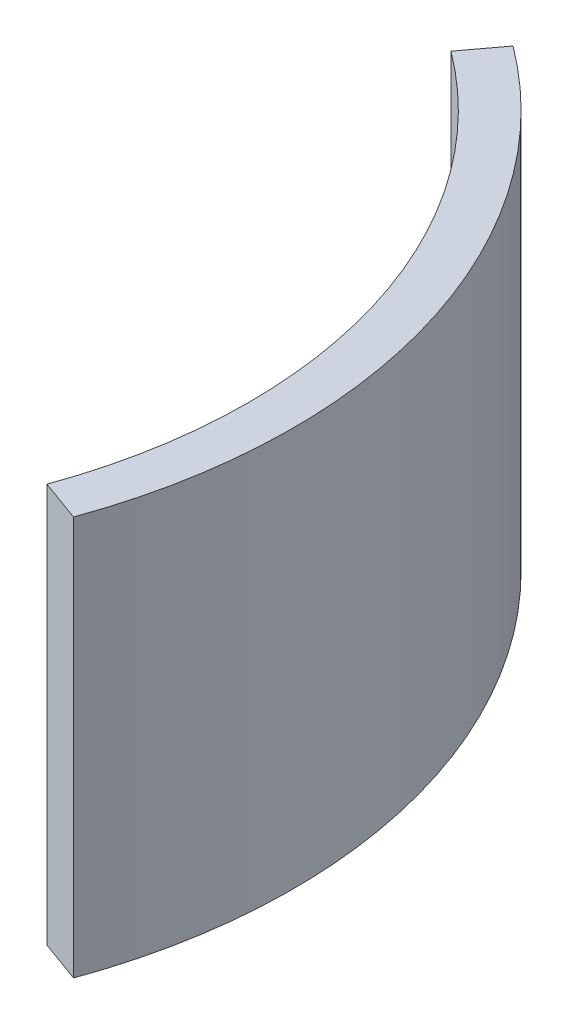
ISO-10303-21;
HEADER;
FILE_DESCRIPTION(('STEP AP214'),'2;1');
FILE_NAME('part.step','',(''),(''),'','','');
FILE_SCHEMA(('AUTOMOTIVE_DESIGN { 1 0 10303 214 1 1 1 1 }'));
ENDSEC;
DATA;
#1=APPLICATION_CONTEXT('core data for automotive mechanical design processes');
#2=APPLICATION_PROTOCOL_DEFINITION('international standard','automotive_design',2000,#1);
#3=PRODUCT_CONTEXT('',#1,'mechanical');
#4=PRODUCT('Part','Part','',(#3));
#5=PRODUCT_RELATED_PRODUCT_CATEGORY('part','',(#4));
#6=PRODUCT_DEFINITION_FORMATION('','',#4);
#7=PRODUCT_DEFINITION_CONTEXT('part definition',#1,'design');
#8=PRODUCT_DEFINITION('design','',#6,#7);
#9=PRODUCT_DEFINITION_SHAPE('','',#8);
#10=(LENGTH_UNIT() NAMED_UNIT(*) SI_UNIT(.MILLI.,.METRE.));
#11=(NAMED_UNIT(*) PLANE_ANGLE_UNIT() SI_UNIT($,.RADIAN.));
#12=(NAMED_UNIT(*) SI_UNIT($,.STERADIAN.) SOLID_ANGLE_UNIT());
#13=UNCERTAINTY_MEASURE_WITH_UNIT(LENGTH_MEASURE(1.E-05),#10,'distance_accuracy_value','');
#14=(GEOMETRIC_REPRESENTATION_CONTEXT(3) GLOBAL_UNCERTAINTY_ASSIGNED_CONTEXT((#13)) GLOBAL_UNIT_ASSIGNED_CONTEXT((#10,
#11,#12)) REPRESENTATION_CONTEXT('',''));
#15=CARTESIAN_POINT('',(0.,0.,0.));
#16=DIRECTION('',(0.,0.,1.));
#17=DIRECTION('',(1.,0.,0.));
#18=AXIS2_PLACEMENT_3D('',#15,#16,#17);
#19=CARTESIAN_POINT('',(0.,45.,0.));
#20=DIRECTION('',(0.,-1.,0.));
#21=DIRECTION('',(0.,0.,-1.));
#22=AXIS2_PLACEMENT_3D('',#19,#20,#21);
#23=CYLINDRICAL_SURFACE('',#22,57.);
#24=CARTESIAN_POINT('',(0.,0.,0.));
#25=DIRECTION('',(0.,-1.,0.));
#26=DIRECTION('',(0.,0.,1.));
#27=AXIS2_PLACEMENT_3D('',#24,#25,#26);
#28=CIRCLE('',#27,57.);
#29=CARTESIAN_POINT('',(34.1112324863722,0.,-45.6664408319793));
#30=VERTEX_POINT('',#29);
#31=CARTESIAN_POINT('',(53.6074029330243,0.,19.3712764364246));
#32=VERTEX_POINT('',#31);
#33=EDGE_CURVE('E97',#30,#32,#28,.T.);
#34=ORIENTED_EDGE('',*,*,#33,.T.);
#35=DIRECTION('',(0.,-1.,0.));
#36=VECTOR('',#35,1.);
#37=CARTESIAN_POINT('',(53.6074029330243,45.,19.3712764364246));
#38=LINE('',#37,#36);
#39=CARTESIAN_POINT('',(53.6074029330243,45.,19.3712764364246));
#40=VERTEX_POINT('',#39);
#41=EDGE_CURVE('E11',#40,#32,#38,.T.);
#42=ORIENTED_EDGE('',*,*,#41,.F.);
#43=CARTESIAN_POINT('',(0.,45.,0.));
#44=DIRECTION('',(0.,-1.,0.));
#45=DIRECTION('',(0.,0.,1.));
#46=AXIS2_PLACEMENT_3D('',#43,#44,#45);
#47=CIRCLE('',#46,57.);
#48=CARTESIAN_POINT('',(34.1112324863722,45.,-45.6664408319793));
#49=VERTEX_POINT('',#48);
#50=EDGE_CURVE('E85',#49,#40,#47,.T.);
#51=ORIENTED_EDGE('',*,*,#50,.F.);
#52=DIRECTION('',(0.,-1.,0.));
#53=VECTOR('',#52,1.);
#54=CARTESIAN_POINT('',(34.1112324863722,45.,-45.6664408319793));
#55=LINE('',#54,#53);
#56=EDGE_CURVE('E93',#49,#30,#55,.T.);
#57=ORIENTED_EDGE('',*,*,#56,.T.);
#58=EDGE_LOOP('',(#34,#42,#51,#57));
#59=FACE_BOUND('',#58,.T.);
#60=ADVANCED_FACE('F34',(#59),#23,.F.);
#61=CARTESIAN_POINT('',(53.6074029330243,45.,19.3712764364246));
#62=DIRECTION('',(0.339846955024993,0.,-0.940480753210953));
#63=DIRECTION('',(-0.940480753210953,0.,-0.339846955024993));
#64=AXIS2_PLACEMENT_3D('',#61,#62,#63);
#65=PLANE('',#64);
#66=DIRECTION('',(0.940480753210953,0.,0.339846955024993));
#67=VECTOR('',#66,1.);
#68=CARTESIAN_POINT('',(53.6074029330243,0.,19.3712764364246));
#69=LINE('',#68,#67);
#70=CARTESIAN_POINT('',(58.3098066990791,0.,21.0705112115495));
#71=VERTEX_POINT('',#70);
#72=EDGE_CURVE('E89',#32,#71,#69,.T.);
#73=ORIENTED_EDGE('',*,*,#72,.T.);
#74=DIRECTION('',(0.,-1.,0.));
#75=VECTOR('',#74,1.);
#76=CARTESIAN_POINT('',(58.3098066990791,45.,21.0705112115495));
#77=LINE('',#76,#75);
#78=CARTESIAN_POINT('',(58.3098066990791,45.,21.0705112115495));
#79=VERTEX_POINT('',#78);
#80=EDGE_CURVE('E42',#79,#71,#77,.T.);
#81=ORIENTED_EDGE('',*,*,#80,.F.);
#82=DIRECTION('',(0.940480753210953,0.,0.339846955024993));
#83=VECTOR('',#82,1.);
#84=CARTESIAN_POINT('',(53.6074029330243,45.,19.3712764364246));
#85=LINE('',#84,#83);
#86=EDGE_CURVE('E80',#40,#79,#85,.T.);
#87=ORIENTED_EDGE('',*,*,#86,.F.);
#88=ORIENTED_EDGE('',*,*,#41,.T.);
#89=EDGE_LOOP('',(#73,#81,#87,#88));
#90=FACE_BOUND('',#89,.T.);
#91=ADVANCED_FACE('F88',(#90),#65,.F.);
#92=CARTESIAN_POINT('',(0.,45.,0.));
#93=DIRECTION('',(0.,-1.,0.));
#94=DIRECTION('',(0.,0.,-1.));
#95=AXIS2_PLACEMENT_3D('',#92,#93,#94);
#96=CYLINDRICAL_SURFACE('',#95,62.);
#97=CARTESIAN_POINT('',(0.,0.,0.));
#98=DIRECTION('',(0.,1.,0.));
#99=DIRECTION('',(0.,0.,1.));
#100=AXIS2_PLACEMENT_3D('',#97,#98,#99);
#101=CIRCLE('',#100,62.);
#102=CARTESIAN_POINT('',(37.1034458623698,0.,-49.6722689751354));
#103=VERTEX_POINT('',#102);
#104=EDGE_CURVE('E67',#71,#103,#101,.T.);
#105=ORIENTED_EDGE('',*,*,#104,.T.);
#106=DIRECTION('',(0.,-1.,0.));
#107=VECTOR('',#106,1.);
#108=CARTESIAN_POINT('',(37.1034458623698,45.,-49.6722689751354));
#109=LINE('',#108,#107);
#110=CARTESIAN_POINT('',(37.1034458623698,45.,-49.6722689751354));
#111=VERTEX_POINT('',#110);
#112=EDGE_CURVE('E90',#111,#103,#109,.T.);
#113=ORIENTED_EDGE('',*,*,#112,.F.);
#114=CARTESIAN_POINT('',(0.,45.,0.));
#115=DIRECTION('',(0.,1.,0.));
#116=DIRECTION('',(0.,0.,1.));
#117=AXIS2_PLACEMENT_3D('',#114,#115,#116);
#118=CIRCLE('',#117,62.);
#119=EDGE_CURVE('E83',#79,#111,#118,.T.);
#120=ORIENTED_EDGE('',*,*,#119,.F.);
#121=ORIENTED_EDGE('',*,*,#80,.T.);
#122=EDGE_LOOP('',(#105,#113,#120,#121));
#123=FACE_BOUND('',#122,.T.);
#124=ADVANCED_FACE('F91',(#123),#96,.T.);
#125=CARTESIAN_POINT('',(34.1112324863722,45.,-45.6664408319793));
#126=DIRECTION('',(0.801165628631214,0.,0.598442675199514));
#127=DIRECTION('',(0.598442675199514,0.,-0.801165628631215));
#128=AXIS2_PLACEMENT_3D('',#125,#126,#127);
#129=PLANE('',#128);
#130=DIRECTION('',(-0.598442675199514,0.,0.801165628631214));
#131=VECTOR('',#130,1.);
#132=CARTESIAN_POINT('',(34.1112324863722,0.,-45.6664408319793));
#133=LINE('',#132,#131);
#134=EDGE_CURVE('E73',#103,#30,#133,.T.);
#135=ORIENTED_EDGE('',*,*,#134,.T.);
#136=ORIENTED_EDGE('',*,*,#56,.F.);
#137=DIRECTION('',(-0.598442675199514,0.,0.801165628631214));
#138=VECTOR('',#137,1.);
#139=CARTESIAN_POINT('',(34.1112324863722,45.,-45.6664408319793));
#140=LINE('',#139,#138);
#141=EDGE_CURVE('E50',#111,#49,#140,.T.);
#142=ORIENTED_EDGE('',*,*,#141,.F.);
#143=ORIENTED_EDGE('',*,*,#112,.T.);
#144=EDGE_LOOP('',(#135,#136,#142,#143));
#145=FACE_BOUND('',#144,.T.);
#146=ADVANCED_FACE('F104',(#145),#129,.F.);
#147=CARTESIAN_POINT('',(0.,45.,0.));
#148=DIRECTION('',(0.,1.,0.));
#149=DIRECTION('',(0.,0.,1.));
#150=AXIS2_PLACEMENT_3D('',#147,#148,#149);
#151=PLANE('',#150);
#152=ORIENTED_EDGE('',*,*,#50,.T.);
#153=ORIENTED_EDGE('',*,*,#86,.T.);
#154=ORIENTED_EDGE('',*,*,#119,.T.);
#155=ORIENTED_EDGE('',*,*,#141,.T.);
#156=EDGE_LOOP('',(#152,#153,#154,#155));
#157=FACE_BOUND('',#156,.T.);
#158=ADVANCED_FACE('F81',(#157),#151,.T.);
#159=CARTESIAN_POINT('',(0.,0.,0.));
#160=DIRECTION('',(0.,1.,0.));
#161=DIRECTION('',(0.,0.,1.));
#162=AXIS2_PLACEMENT_3D('',#159,#160,#161);
#163=PLANE('',#162);
#164=ORIENTED_EDGE('',*,*,#33,.F.);
#165=ORIENTED_EDGE('',*,*,#134,.F.);
#166=ORIENTED_EDGE('',*,*,#104,.F.);
#167=ORIENTED_EDGE('',*,*,#72,.F.);
#168=EDGE_LOOP('',(#164,#165,#166,#167));
#169=FACE_BOUND('',#168,.T.);
#170=ADVANCED_FACE('F107',(#169),#163,.F.);
#171=CLOSED_SHELL('',(#60,#91,#124,#146,#158,#170));
#172=MANIFOLD_SOLID_BREP('B2',#171);
#173=ADVANCED_BREP_SHAPE_REPRESENTATION('',(#18,#172),#14);
#174=SHAPE_DEFINITION_REPRESENTATION(#9,#173);
ENDSEC;
END-ISO-10303-21;
